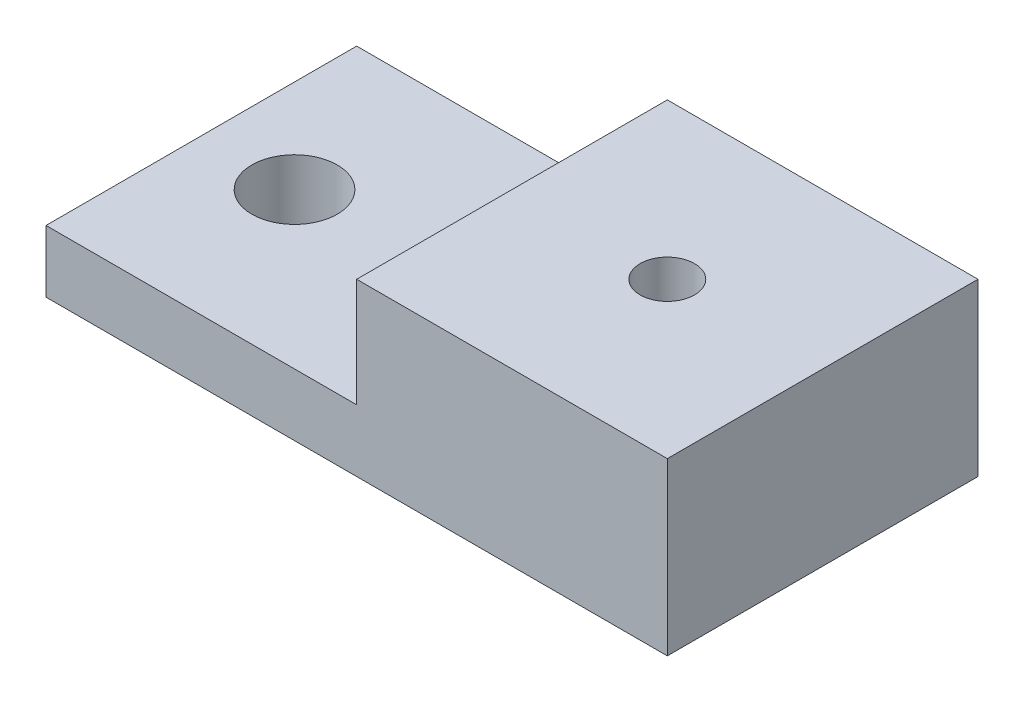
ISO-10303-21;
HEADER;
FILE_DESCRIPTION(('STEP AP214'),'2;1');
FILE_NAME('part.step','',(''),(''),'','','');
FILE_SCHEMA(('AUTOMOTIVE_DESIGN { 1 0 10303 214 1 1 1 1 }'));
ENDSEC;
DATA;
#1=APPLICATION_CONTEXT('core data for automotive mechanical design processes');
#2=APPLICATION_PROTOCOL_DEFINITION('international standard','automotive_design',2000,#1);
#3=PRODUCT_CONTEXT('',#1,'mechanical');
#4=PRODUCT('Part','Part','',(#3));
#5=PRODUCT_RELATED_PRODUCT_CATEGORY('part','',(#4));
#6=PRODUCT_DEFINITION_FORMATION('','',#4);
#7=PRODUCT_DEFINITION_CONTEXT('part definition',#1,'design');
#8=PRODUCT_DEFINITION('design','',#6,#7);
#9=PRODUCT_DEFINITION_SHAPE('','',#8);
#10=(LENGTH_UNIT() NAMED_UNIT(*) SI_UNIT(.MILLI.,.METRE.));
#11=(NAMED_UNIT(*) PLANE_ANGLE_UNIT() SI_UNIT($,.RADIAN.));
#12=(NAMED_UNIT(*) SI_UNIT($,.STERADIAN.) SOLID_ANGLE_UNIT());
#13=UNCERTAINTY_MEASURE_WITH_UNIT(LENGTH_MEASURE(1.E-05),#10,'distance_accuracy_value','');
#14=(GEOMETRIC_REPRESENTATION_CONTEXT(3) GLOBAL_UNCERTAINTY_ASSIGNED_CONTEXT((#13)) GLOBAL_UNIT_ASSIGNED_CONTEXT((#10,
#11,#12)) REPRESENTATION_CONTEXT('',''));
#15=CARTESIAN_POINT('',(0.,0.,0.));
#16=DIRECTION('',(0.,0.,1.));
#17=DIRECTION('',(1.,0.,0.));
#18=AXIS2_PLACEMENT_3D('',#15,#16,#17);
#19=CARTESIAN_POINT('',(30.,0.,-10.));
#20=DIRECTION('',(0.,1.,0.));
#21=DIRECTION('',(0.,0.,1.));
#22=AXIS2_PLACEMENT_3D('',#19,#20,#21);
#23=CYLINDRICAL_SURFACE('',#22,1.75);
#24=CARTESIAN_POINT('',(30.,11.,-10.));
#25=DIRECTION('',(0.,1.,0.));
#26=DIRECTION('',(0.,0.,1.));
#27=AXIS2_PLACEMENT_3D('',#24,#25,#26);
#28=CIRCLE('',#27,1.75);
#29=CARTESIAN_POINT('',(30.,11.,-8.25));
#30=VERTEX_POINT('',#29);
#31=EDGE_CURVE('E181',#30,#30,#28,.T.);
#32=ORIENTED_EDGE('',*,*,#31,.T.);
#33=EDGE_LOOP('',(#32));
#34=FACE_BOUND('',#33,.T.);
#35=CARTESIAN_POINT('',(30.,7.,-10.));
#36=DIRECTION('',(0.,-1.,0.));
#37=DIRECTION('',(0.,0.,-1.));
#38=AXIS2_PLACEMENT_3D('',#35,#36,#37);
#39=CIRCLE('',#38,1.75);
#40=CARTESIAN_POINT('',(30.,7.,-11.75));
#41=VERTEX_POINT('',#40);
#42=EDGE_CURVE('E39',#41,#41,#39,.F.);
#43=ORIENTED_EDGE('',*,*,#42,.F.);
#44=EDGE_LOOP('',(#43));
#45=FACE_BOUND('',#44,.T.);
#46=ADVANCED_FACE('F35',(#34,#45),#23,.F.);
#47=CARTESIAN_POINT('',(0.,4.,0.));
#48=DIRECTION('',(0.,-1.,0.));
#49=DIRECTION('',(0.,0.,-1.));
#50=AXIS2_PLACEMENT_3D('',#47,#48,#49);
#51=PLANE('',#50);
#52=CARTESIAN_POINT('',(6.,4.,-10.));
#53=DIRECTION('',(0.,1.,0.));
#54=DIRECTION('',(0.,0.,1.));
#55=AXIS2_PLACEMENT_3D('',#52,#53,#54);
#56=CIRCLE('',#55,2.75);
#57=CARTESIAN_POINT('',(6.,4.,-7.25));
#58=VERTEX_POINT('',#57);
#59=EDGE_CURVE('E197',#58,#58,#56,.T.);
#60=ORIENTED_EDGE('',*,*,#59,.F.);
#61=EDGE_LOOP('',(#60));
#62=FACE_BOUND('',#61,.T.);
#63=DIRECTION('',(0.,0.,1.));
#64=VECTOR('',#63,1.);
#65=CARTESIAN_POINT('',(20.,4.,-20.));
#66=LINE('',#65,#64);
#67=CARTESIAN_POINT('',(20.,4.,-20.));
#68=VERTEX_POINT('',#67);
#69=CARTESIAN_POINT('',(20.,4.,0.));
#70=VERTEX_POINT('',#69);
#71=EDGE_CURVE('E60',#68,#70,#66,.T.);
#72=ORIENTED_EDGE('',*,*,#71,.F.);
#73=DIRECTION('',(-1.,0.,0.));
#74=VECTOR('',#73,1.);
#75=CARTESIAN_POINT('',(0.,4.,-20.));
#76=LINE('',#75,#74);
#77=CARTESIAN_POINT('',(0.,4.,-20.));
#78=VERTEX_POINT('',#77);
#79=EDGE_CURVE('E202',#68,#78,#76,.T.);
#80=ORIENTED_EDGE('',*,*,#79,.T.);
#81=DIRECTION('',(0.,0.,1.));
#82=VECTOR('',#81,1.);
#83=CARTESIAN_POINT('',(0.,4.,0.));
#84=LINE('',#83,#82);
#85=CARTESIAN_POINT('',(0.,4.,0.));
#86=VERTEX_POINT('',#85);
#87=EDGE_CURVE('E222',#78,#86,#84,.T.);
#88=ORIENTED_EDGE('',*,*,#87,.T.);
#89=DIRECTION('',(1.,0.,0.));
#90=VECTOR('',#89,1.);
#91=CARTESIAN_POINT('',(0.,4.,0.));
#92=LINE('',#91,#90);
#93=EDGE_CURVE('E225',#86,#70,#92,.T.);
#94=ORIENTED_EDGE('',*,*,#93,.T.);
#95=EDGE_LOOP('',(#72,#80,#88,#94));
#96=FACE_BOUND('',#95,.T.);
#97=ADVANCED_FACE('F257',(#62,#96),#51,.F.);
#98=CARTESIAN_POINT('',(0.,0.,0.));
#99=DIRECTION('',(0.,-1.,0.));
#100=DIRECTION('',(0.,0.,-1.));
#101=AXIS2_PLACEMENT_3D('',#98,#99,#100);
#102=PLANE('',#101);
#103=DIRECTION('',(0.866025403784439,0.,-0.5));
#104=VECTOR('',#103,1.);
#105=CARTESIAN_POINT('',(27.2125,0.,-11.6093638753661));
#106=LINE('',#105,#104);
#107=CARTESIAN_POINT('',(27.2125,0.,-11.6093638753661));
#108=VERTEX_POINT('',#107);
#109=CARTESIAN_POINT('',(30.,0.,-13.2187277507322));
#110=VERTEX_POINT('',#109);
#111=EDGE_CURVE('E52',#108,#110,#106,.T.);
#112=ORIENTED_EDGE('',*,*,#111,.F.);
#113=DIRECTION('',(0.,0.,-1.));
#114=VECTOR('',#113,1.);
#115=CARTESIAN_POINT('',(27.2125,0.,-8.39063612463392));
#116=LINE('',#115,#114);
#117=CARTESIAN_POINT('',(27.2125,0.,-8.39063612463392));
#118=VERTEX_POINT('',#117);
#119=EDGE_CURVE('E148',#118,#108,#116,.T.);
#120=ORIENTED_EDGE('',*,*,#119,.F.);
#121=DIRECTION('',(-0.866025403784439,0.,-0.5));
#122=VECTOR('',#121,1.);
#123=CARTESIAN_POINT('',(30.,0.,-6.78127224926783));
#124=LINE('',#123,#122);
#125=CARTESIAN_POINT('',(30.,0.,-6.78127224926783));
#126=VERTEX_POINT('',#125);
#127=EDGE_CURVE('E151',#126,#118,#124,.T.);
#128=ORIENTED_EDGE('',*,*,#127,.F.);
#129=DIRECTION('',(-0.866025403784439,0.,0.5));
#130=VECTOR('',#129,1.);
#131=CARTESIAN_POINT('',(32.7875,0.,-8.39063612463392));
#132=LINE('',#131,#130);
#133=CARTESIAN_POINT('',(32.7875,0.,-8.39063612463392));
#134=VERTEX_POINT('',#133);
#135=EDGE_CURVE('E167',#134,#126,#132,.T.);
#136=ORIENTED_EDGE('',*,*,#135,.F.);
#137=DIRECTION('',(0.,0.,1.));
#138=VECTOR('',#137,1.);
#139=CARTESIAN_POINT('',(32.7875,0.,-11.6093638753661));
#140=LINE('',#139,#138);
#141=CARTESIAN_POINT('',(32.7875,0.,-11.6093638753661));
#142=VERTEX_POINT('',#141);
#143=EDGE_CURVE('E164',#142,#134,#140,.T.);
#144=ORIENTED_EDGE('',*,*,#143,.F.);
#145=DIRECTION('',(0.866025403784438,0.,0.5));
#146=VECTOR('',#145,1.);
#147=CARTESIAN_POINT('',(30.,0.,-13.2187277507322));
#148=LINE('',#147,#146);
#149=EDGE_CURVE('E162',#110,#142,#148,.T.);
#150=ORIENTED_EDGE('',*,*,#149,.F.);
#151=EDGE_LOOP('',(#112,#120,#128,#136,#144,#150));
#152=FACE_BOUND('',#151,.T.);
#153=DIRECTION('',(0.,0.,1.));
#154=VECTOR('',#153,1.);
#155=CARTESIAN_POINT('',(0.,0.,0.));
#156=LINE('',#155,#154);
#157=CARTESIAN_POINT('',(0.,0.,-20.));
#158=VERTEX_POINT('',#157);
#159=CARTESIAN_POINT('',(0.,0.,0.));
#160=VERTEX_POINT('',#159);
#161=EDGE_CURVE('E220',#158,#160,#156,.T.);
#162=ORIENTED_EDGE('',*,*,#161,.F.);
#163=DIRECTION('',(-1.,0.,0.));
#164=VECTOR('',#163,1.);
#165=CARTESIAN_POINT('',(0.,0.,-20.));
#166=LINE('',#165,#164);
#167=CARTESIAN_POINT('',(40.,0.,-20.));
#168=VERTEX_POINT('',#167);
#169=EDGE_CURVE('E226',#168,#158,#166,.T.);
#170=ORIENTED_EDGE('',*,*,#169,.F.);
#171=DIRECTION('',(0.,0.,-1.));
#172=VECTOR('',#171,1.);
#173=CARTESIAN_POINT('',(40.,0.,0.));
#174=LINE('',#173,#172);
#175=CARTESIAN_POINT('',(40.,0.,0.));
#176=VERTEX_POINT('',#175);
#177=EDGE_CURVE('E240',#176,#168,#174,.T.);
#178=ORIENTED_EDGE('',*,*,#177,.F.);
#179=DIRECTION('',(1.,0.,0.));
#180=VECTOR('',#179,1.);
#181=CARTESIAN_POINT('',(0.,0.,0.));
#182=LINE('',#181,#180);
#183=EDGE_CURVE('E242',#160,#176,#182,.T.);
#184=ORIENTED_EDGE('',*,*,#183,.F.);
#185=EDGE_LOOP('',(#162,#170,#178,#184));
#186=FACE_BOUND('',#185,.T.);
#187=CARTESIAN_POINT('',(6.,0.,-10.));
#188=DIRECTION('',(0.,1.,0.));
#189=DIRECTION('',(0.,0.,1.));
#190=AXIS2_PLACEMENT_3D('',#187,#188,#189);
#191=CIRCLE('',#190,2.75);
#192=CARTESIAN_POINT('',(6.,0.,-7.25));
#193=VERTEX_POINT('',#192);
#194=EDGE_CURVE('E211',#193,#193,#191,.T.);
#195=ORIENTED_EDGE('',*,*,#194,.T.);
#196=EDGE_LOOP('',(#195));
#197=FACE_BOUND('',#196,.T.);
#198=ADVANCED_FACE('F251',(#152,#186,#197),#102,.T.);
#199=CARTESIAN_POINT('',(0.,4.,0.));
#200=DIRECTION('',(1.,0.,0.));
#201=DIRECTION('',(0.,0.,-1.));
#202=AXIS2_PLACEMENT_3D('',#199,#200,#201);
#203=PLANE('',#202);
#204=ORIENTED_EDGE('',*,*,#161,.T.);
#205=DIRECTION('',(0.,-1.,0.));
#206=VECTOR('',#205,1.);
#207=CARTESIAN_POINT('',(0.,4.,0.));
#208=LINE('',#207,#206);
#209=EDGE_CURVE('E11',#86,#160,#208,.T.);
#210=ORIENTED_EDGE('',*,*,#209,.F.);
#211=ORIENTED_EDGE('',*,*,#87,.F.);
#212=DIRECTION('',(0.,-1.,0.));
#213=VECTOR('',#212,1.);
#214=CARTESIAN_POINT('',(0.,4.,-20.));
#215=LINE('',#214,#213);
#216=EDGE_CURVE('E236',#78,#158,#215,.T.);
#217=ORIENTED_EDGE('',*,*,#216,.T.);
#218=EDGE_LOOP('',(#204,#210,#211,#217));
#219=FACE_BOUND('',#218,.T.);
#220=ADVANCED_FACE('F37',(#219),#203,.F.);
#221=CARTESIAN_POINT('',(0.,4.,0.));
#222=DIRECTION('',(0.,0.,-1.));
#223=DIRECTION('',(-1.,0.,0.));
#224=AXIS2_PLACEMENT_3D('',#221,#222,#223);
#225=PLANE('',#224);
#226=ORIENTED_EDGE('',*,*,#183,.T.);
#227=DIRECTION('',(0.,-1.,0.));
#228=VECTOR('',#227,1.);
#229=CARTESIAN_POINT('',(40.,4.,0.));
#230=LINE('',#229,#228);
#231=CARTESIAN_POINT('',(40.,11.,0.));
#232=VERTEX_POINT('',#231);
#233=EDGE_CURVE('E44',#232,#176,#230,.T.);
#234=ORIENTED_EDGE('',*,*,#233,.F.);
#235=DIRECTION('',(1.,0.,0.));
#236=VECTOR('',#235,1.);
#237=CARTESIAN_POINT('',(40.,11.,0.));
#238=LINE('',#237,#236);
#239=CARTESIAN_POINT('',(20.,11.,0.));
#240=VERTEX_POINT('',#239);
#241=EDGE_CURVE('E191',#240,#232,#238,.T.);
#242=ORIENTED_EDGE('',*,*,#241,.F.);
#243=DIRECTION('',(0.,-1.,0.));
#244=VECTOR('',#243,1.);
#245=CARTESIAN_POINT('',(20.,11.,0.));
#246=LINE('',#245,#244);
#247=EDGE_CURVE('E194',#240,#70,#246,.T.);
#248=ORIENTED_EDGE('',*,*,#247,.T.);
#249=ORIENTED_EDGE('',*,*,#93,.F.);
#250=ORIENTED_EDGE('',*,*,#209,.T.);
#251=EDGE_LOOP('',(#226,#234,#242,#248,#249,#250));
#252=FACE_BOUND('',#251,.T.);
#253=ADVANCED_FACE('F254',(#252),#225,.F.);
#254=CARTESIAN_POINT('',(40.,4.,0.));
#255=DIRECTION('',(-1.,0.,0.));
#256=DIRECTION('',(0.,0.,1.));
#257=AXIS2_PLACEMENT_3D('',#254,#255,#256);
#258=PLANE('',#257);
#259=ORIENTED_EDGE('',*,*,#177,.T.);
#260=DIRECTION('',(0.,-1.,0.));
#261=VECTOR('',#260,1.);
#262=CARTESIAN_POINT('',(40.,4.,-20.));
#263=LINE('',#262,#261);
#264=CARTESIAN_POINT('',(40.,11.,-20.));
#265=VERTEX_POINT('',#264);
#266=EDGE_CURVE('E233',#265,#168,#263,.T.);
#267=ORIENTED_EDGE('',*,*,#266,.F.);
#268=DIRECTION('',(0.,0.,-1.));
#269=VECTOR('',#268,1.);
#270=CARTESIAN_POINT('',(40.,11.,-20.));
#271=LINE('',#270,#269);
#272=EDGE_CURVE('E184',#232,#265,#271,.T.);
#273=ORIENTED_EDGE('',*,*,#272,.F.);
#274=ORIENTED_EDGE('',*,*,#233,.T.);
#275=EDGE_LOOP('',(#259,#267,#273,#274));
#276=FACE_BOUND('',#275,.T.);
#277=ADVANCED_FACE('F263',(#276),#258,.F.);
#278=CARTESIAN_POINT('',(0.,4.,-20.));
#279=DIRECTION('',(0.,0.,1.));
#280=DIRECTION('',(1.,0.,0.));
#281=AXIS2_PLACEMENT_3D('',#278,#279,#280);
#282=PLANE('',#281);
#283=ORIENTED_EDGE('',*,*,#169,.T.);
#284=ORIENTED_EDGE('',*,*,#216,.F.);
#285=ORIENTED_EDGE('',*,*,#79,.F.);
#286=DIRECTION('',(0.,-1.,0.));
#287=VECTOR('',#286,1.);
#288=CARTESIAN_POINT('',(20.,11.,-20.));
#289=LINE('',#288,#287);
#290=CARTESIAN_POINT('',(20.,11.,-20.));
#291=VERTEX_POINT('',#290);
#292=EDGE_CURVE('E207',#291,#68,#289,.T.);
#293=ORIENTED_EDGE('',*,*,#292,.F.);
#294=DIRECTION('',(-1.,0.,0.));
#295=VECTOR('',#294,1.);
#296=CARTESIAN_POINT('',(40.,11.,-20.));
#297=LINE('',#296,#295);
#298=EDGE_CURVE('E187',#265,#291,#297,.T.);
#299=ORIENTED_EDGE('',*,*,#298,.F.);
#300=ORIENTED_EDGE('',*,*,#266,.T.);
#301=EDGE_LOOP('',(#283,#284,#285,#293,#299,#300));
#302=FACE_BOUND('',#301,.T.);
#303=ADVANCED_FACE('F259',(#302),#282,.F.);
#304=CARTESIAN_POINT('',(6.,4.,-10.));
#305=DIRECTION('',(0.,-1.,0.));
#306=DIRECTION('',(0.,0.,-1.));
#307=AXIS2_PLACEMENT_3D('',#304,#305,#306);
#308=CYLINDRICAL_SURFACE('',#307,2.75);
#309=ORIENTED_EDGE('',*,*,#59,.T.);
#310=EDGE_LOOP('',(#309));
#311=FACE_BOUND('',#310,.T.);
#312=ORIENTED_EDGE('',*,*,#194,.F.);
#313=EDGE_LOOP('',(#312));
#314=FACE_BOUND('',#313,.T.);
#315=ADVANCED_FACE('F268',(#311,#314),#308,.F.);
#316=CARTESIAN_POINT('',(20.,11.,-20.));
#317=DIRECTION('',(1.,0.,0.));
#318=DIRECTION('',(0.,0.,-1.));
#319=AXIS2_PLACEMENT_3D('',#316,#317,#318);
#320=PLANE('',#319);
#321=ORIENTED_EDGE('',*,*,#71,.T.);
#322=ORIENTED_EDGE('',*,*,#247,.F.);
#323=DIRECTION('',(0.,0.,1.));
#324=VECTOR('',#323,1.);
#325=CARTESIAN_POINT('',(20.,11.,-20.));
#326=LINE('',#325,#324);
#327=EDGE_CURVE('E189',#291,#240,#326,.T.);
#328=ORIENTED_EDGE('',*,*,#327,.F.);
#329=ORIENTED_EDGE('',*,*,#292,.T.);
#330=EDGE_LOOP('',(#321,#322,#328,#329));
#331=FACE_BOUND('',#330,.T.);
#332=ADVANCED_FACE('F266',(#331),#320,.F.);
#333=CARTESIAN_POINT('',(0.,11.,0.));
#334=DIRECTION('',(0.,-1.,0.));
#335=DIRECTION('',(0.,0.,-1.));
#336=AXIS2_PLACEMENT_3D('',#333,#334,#335);
#337=PLANE('',#336);
#338=ORIENTED_EDGE('',*,*,#31,.F.);
#339=EDGE_LOOP('',(#338));
#340=FACE_BOUND('',#339,.T.);
#341=ORIENTED_EDGE('',*,*,#272,.T.);
#342=ORIENTED_EDGE('',*,*,#298,.T.);
#343=ORIENTED_EDGE('',*,*,#327,.T.);
#344=ORIENTED_EDGE('',*,*,#241,.T.);
#345=EDGE_LOOP('',(#341,#342,#343,#344));
#346=FACE_BOUND('',#345,.T.);
#347=ADVANCED_FACE('F265',(#340,#346),#337,.F.);
#348=CARTESIAN_POINT('',(0.,7.,0.));
#349=DIRECTION('',(0.,-1.,0.));
#350=DIRECTION('',(0.,0.,-1.));
#351=AXIS2_PLACEMENT_3D('',#348,#349,#350);
#352=PLANE('',#351);
#353=DIRECTION('',(0.866025403784439,0.,-0.5));
#354=VECTOR('',#353,1.);
#355=CARTESIAN_POINT('',(27.2125,7.,-11.6093638753661));
#356=LINE('',#355,#354);
#357=CARTESIAN_POINT('',(27.2125,7.,-11.6093638753661));
#358=VERTEX_POINT('',#357);
#359=CARTESIAN_POINT('',(30.,7.,-13.2187277507322));
#360=VERTEX_POINT('',#359);
#361=EDGE_CURVE('E128',#358,#360,#356,.T.);
#362=ORIENTED_EDGE('',*,*,#361,.T.);
#363=DIRECTION('',(0.866025403784438,0.,0.5));
#364=VECTOR('',#363,1.);
#365=CARTESIAN_POINT('',(30.,7.,-13.2187277507322));
#366=LINE('',#365,#364);
#367=CARTESIAN_POINT('',(32.7875,7.,-11.6093638753661));
#368=VERTEX_POINT('',#367);
#369=EDGE_CURVE('E137',#360,#368,#366,.T.);
#370=ORIENTED_EDGE('',*,*,#369,.T.);
#371=DIRECTION('',(0.,0.,1.));
#372=VECTOR('',#371,1.);
#373=CARTESIAN_POINT('',(32.7875,7.,-11.6093638753661));
#374=LINE('',#373,#372);
#375=CARTESIAN_POINT('',(32.7875,7.,-8.39063612463392));
#376=VERTEX_POINT('',#375);
#377=EDGE_CURVE('E142',#368,#376,#374,.T.);
#378=ORIENTED_EDGE('',*,*,#377,.T.);
#379=DIRECTION('',(-0.866025403784439,0.,0.5));
#380=VECTOR('',#379,1.);
#381=CARTESIAN_POINT('',(32.7875,7.,-8.39063612463392));
#382=LINE('',#381,#380);
#383=CARTESIAN_POINT('',(30.,7.,-6.78127224926783));
#384=VERTEX_POINT('',#383);
#385=EDGE_CURVE('E155',#376,#384,#382,.T.);
#386=ORIENTED_EDGE('',*,*,#385,.T.);
#387=DIRECTION('',(-0.866025403784439,0.,-0.5));
#388=VECTOR('',#387,1.);
#389=CARTESIAN_POINT('',(30.,7.,-6.78127224926783));
#390=LINE('',#389,#388);
#391=CARTESIAN_POINT('',(27.2125,7.,-8.39063612463392));
#392=VERTEX_POINT('',#391);
#393=EDGE_CURVE('E158',#384,#392,#390,.T.);
#394=ORIENTED_EDGE('',*,*,#393,.T.);
#395=DIRECTION('',(0.,0.,-1.));
#396=VECTOR('',#395,1.);
#397=CARTESIAN_POINT('',(27.2125,7.,-8.39063612463392));
#398=LINE('',#397,#396);
#399=EDGE_CURVE('E134',#392,#358,#398,.T.);
#400=ORIENTED_EDGE('',*,*,#399,.T.);
#401=EDGE_LOOP('',(#362,#370,#378,#386,#394,#400));
#402=FACE_BOUND('',#401,.T.);
#403=ORIENTED_EDGE('',*,*,#42,.T.);
#404=EDGE_LOOP('',(#403));
#405=FACE_BOUND('',#404,.T.);
#406=ADVANCED_FACE('F144',(#402,#405),#352,.T.);
#407=CARTESIAN_POINT('',(27.2125,7.,-11.6093638753661));
#408=DIRECTION('',(-0.5,0.,-0.866025403784439));
#409=DIRECTION('',(-0.866025403784439,0.,0.5));
#410=AXIS2_PLACEMENT_3D('',#407,#408,#409);
#411=PLANE('',#410);
#412=ORIENTED_EDGE('',*,*,#111,.T.);
#413=DIRECTION('',(0.,-1.,0.));
#414=VECTOR('',#413,1.);
#415=CARTESIAN_POINT('',(30.,7.,-13.2187277507322));
#416=LINE('',#415,#414);
#417=EDGE_CURVE('E124',#360,#110,#416,.T.);
#418=ORIENTED_EDGE('',*,*,#417,.F.);
#419=ORIENTED_EDGE('',*,*,#361,.F.);
#420=DIRECTION('',(0.,-1.,0.));
#421=VECTOR('',#420,1.);
#422=CARTESIAN_POINT('',(27.2125,7.,-11.6093638753661));
#423=LINE('',#422,#421);
#424=EDGE_CURVE('E172',#358,#108,#423,.T.);
#425=ORIENTED_EDGE('',*,*,#424,.T.);
#426=EDGE_LOOP('',(#412,#418,#419,#425));
#427=FACE_BOUND('',#426,.T.);
#428=ADVANCED_FACE('F126',(#427),#411,.F.);
#429=CARTESIAN_POINT('',(27.2125,7.,-8.39063612463392));
#430=DIRECTION('',(-1.,0.,0.));
#431=DIRECTION('',(0.,0.,1.));
#432=AXIS2_PLACEMENT_3D('',#429,#430,#431);
#433=PLANE('',#432);
#434=ORIENTED_EDGE('',*,*,#119,.T.);
#435=ORIENTED_EDGE('',*,*,#424,.F.);
#436=ORIENTED_EDGE('',*,*,#399,.F.);
#437=DIRECTION('',(0.,-1.,0.));
#438=VECTOR('',#437,1.);
#439=CARTESIAN_POINT('',(27.2125,7.,-8.39063612463392));
#440=LINE('',#439,#438);
#441=EDGE_CURVE('E174',#392,#118,#440,.T.);
#442=ORIENTED_EDGE('',*,*,#441,.T.);
#443=EDGE_LOOP('',(#434,#435,#436,#442));
#444=FACE_BOUND('',#443,.T.);
#445=ADVANCED_FACE('F290',(#444),#433,.F.);
#446=CARTESIAN_POINT('',(30.,7.,-6.78127224926783));
#447=DIRECTION('',(-0.5,0.,0.866025403784439));
#448=DIRECTION('',(0.866025403784439,0.,0.5));
#449=AXIS2_PLACEMENT_3D('',#446,#447,#448);
#450=PLANE('',#449);
#451=ORIENTED_EDGE('',*,*,#127,.T.);
#452=ORIENTED_EDGE('',*,*,#441,.F.);
#453=ORIENTED_EDGE('',*,*,#393,.F.);
#454=DIRECTION('',(0.,-1.,0.));
#455=VECTOR('',#454,1.);
#456=CARTESIAN_POINT('',(30.,7.,-6.78127224926783));
#457=LINE('',#456,#455);
#458=EDGE_CURVE('E176',#384,#126,#457,.T.);
#459=ORIENTED_EDGE('',*,*,#458,.T.);
#460=EDGE_LOOP('',(#451,#452,#453,#459));
#461=FACE_BOUND('',#460,.T.);
#462=ADVANCED_FACE('F300',(#461),#450,.F.);
#463=CARTESIAN_POINT('',(32.7875,7.,-8.39063612463392));
#464=DIRECTION('',(0.5,0.,0.866025403784439));
#465=DIRECTION('',(0.866025403784439,0.,-0.5));
#466=AXIS2_PLACEMENT_3D('',#463,#464,#465);
#467=PLANE('',#466);
#468=ORIENTED_EDGE('',*,*,#135,.T.);
#469=ORIENTED_EDGE('',*,*,#458,.F.);
#470=ORIENTED_EDGE('',*,*,#385,.F.);
#471=DIRECTION('',(0.,-1.,0.));
#472=VECTOR('',#471,1.);
#473=CARTESIAN_POINT('',(32.7875,7.,-8.39063612463392));
#474=LINE('',#473,#472);
#475=EDGE_CURVE('E178',#376,#134,#474,.T.);
#476=ORIENTED_EDGE('',*,*,#475,.T.);
#477=EDGE_LOOP('',(#468,#469,#470,#476));
#478=FACE_BOUND('',#477,.T.);
#479=ADVANCED_FACE('F296',(#478),#467,.F.);
#480=CARTESIAN_POINT('',(32.7875,7.,-11.6093638753661));
#481=DIRECTION('',(1.,0.,0.));
#482=DIRECTION('',(0.,0.,-1.));
#483=AXIS2_PLACEMENT_3D('',#480,#481,#482);
#484=PLANE('',#483);
#485=ORIENTED_EDGE('',*,*,#143,.T.);
#486=ORIENTED_EDGE('',*,*,#475,.F.);
#487=ORIENTED_EDGE('',*,*,#377,.F.);
#488=DIRECTION('',(0.,-1.,0.));
#489=VECTOR('',#488,1.);
#490=CARTESIAN_POINT('',(32.7875,7.,-11.6093638753661));
#491=LINE('',#490,#489);
#492=EDGE_CURVE('E133',#368,#142,#491,.T.);
#493=ORIENTED_EDGE('',*,*,#492,.T.);
#494=EDGE_LOOP('',(#485,#486,#487,#493));
#495=FACE_BOUND('',#494,.T.);
#496=ADVANCED_FACE('F293',(#495),#484,.F.);
#497=CARTESIAN_POINT('',(30.,7.,-13.2187277507322));
#498=DIRECTION('',(0.5,0.,-0.866025403784438));
#499=DIRECTION('',(-0.866025403784439,0.,-0.5));
#500=AXIS2_PLACEMENT_3D('',#497,#498,#499);
#501=PLANE('',#500);
#502=ORIENTED_EDGE('',*,*,#149,.T.);
#503=ORIENTED_EDGE('',*,*,#492,.F.);
#504=ORIENTED_EDGE('',*,*,#369,.F.);
#505=ORIENTED_EDGE('',*,*,#417,.T.);
#506=EDGE_LOOP('',(#502,#503,#504,#505));
#507=FACE_BOUND('',#506,.T.);
#508=ADVANCED_FACE('F138',(#507),#501,.F.);
#509=CLOSED_SHELL('',(#46,#97,#198,#220,#253,#277,#303,#315,#332,#347,#406,#428,#445,#462,#479,
#496,#508));
#510=MANIFOLD_SOLID_BREP('B2',#509);
#511=ADVANCED_BREP_SHAPE_REPRESENTATION('',(#18,#510),#14);
#512=SHAPE_DEFINITION_REPRESENTATION(#9,#511);
ENDSEC;
END-ISO-10303-21;
